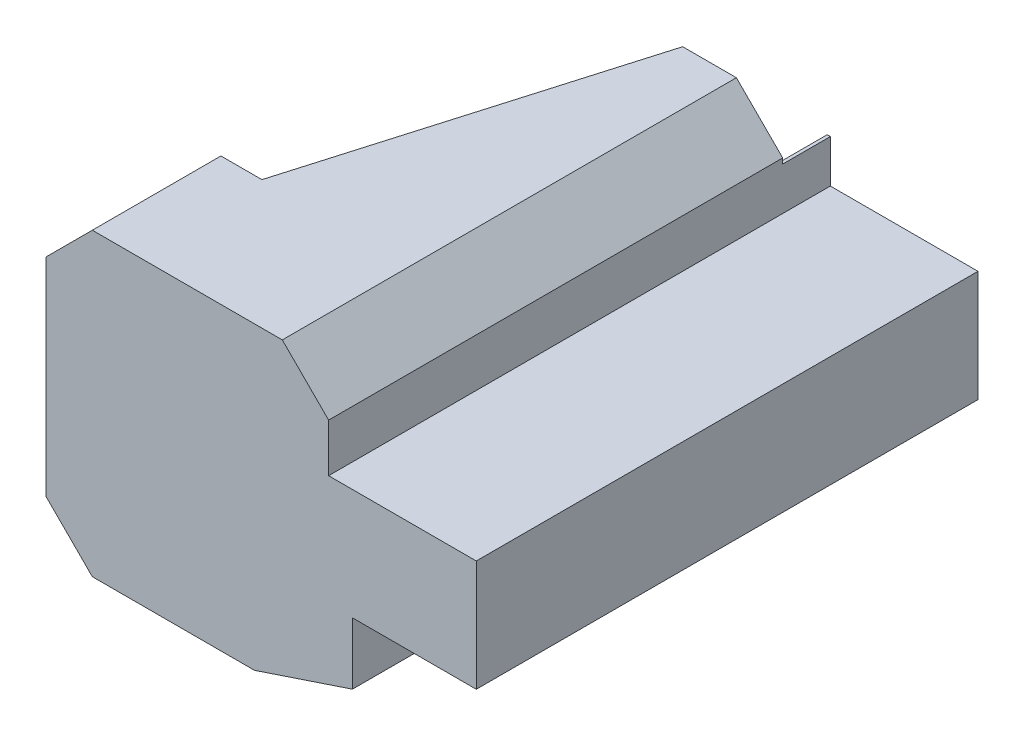
ISO-10303-21;
HEADER;
FILE_DESCRIPTION(('STEP AP214'),'2;1');
FILE_NAME('part.step','',(''),(''),'','','');
FILE_SCHEMA(('AUTOMOTIVE_DESIGN { 1 0 10303 214 1 1 1 1 }'));
ENDSEC;
DATA;
#1=APPLICATION_CONTEXT('core data for automotive mechanical design processes');
#2=APPLICATION_PROTOCOL_DEFINITION('international standard','automotive_design',2000,#1);
#3=PRODUCT_CONTEXT('',#1,'mechanical');
#4=PRODUCT('Part','Part','',(#3));
#5=PRODUCT_RELATED_PRODUCT_CATEGORY('part','',(#4));
#6=PRODUCT_DEFINITION_FORMATION('','',#4);
#7=PRODUCT_DEFINITION_CONTEXT('part definition',#1,'design');
#8=PRODUCT_DEFINITION('design','',#6,#7);
#9=PRODUCT_DEFINITION_SHAPE('','',#8);
#10=(LENGTH_UNIT() NAMED_UNIT(*) SI_UNIT(.MILLI.,.METRE.));
#11=(NAMED_UNIT(*) PLANE_ANGLE_UNIT() SI_UNIT($,.RADIAN.));
#12=(NAMED_UNIT(*) SI_UNIT($,.STERADIAN.) SOLID_ANGLE_UNIT());
#13=UNCERTAINTY_MEASURE_WITH_UNIT(LENGTH_MEASURE(1.E-05),#10,'distance_accuracy_value','');
#14=(GEOMETRIC_REPRESENTATION_CONTEXT(3) GLOBAL_UNCERTAINTY_ASSIGNED_CONTEXT((#13)) GLOBAL_UNIT_ASSIGNED_CONTEXT((#10,
#11,#12)) REPRESENTATION_CONTEXT('',''));
#15=CARTESIAN_POINT('',(0.,0.,0.));
#16=DIRECTION('',(0.,0.,1.));
#17=DIRECTION('',(1.,0.,0.));
#18=AXIS2_PLACEMENT_3D('',#15,#16,#17);
#19=CARTESIAN_POINT('',(0.,154.328427124746,-314.));
#20=DIRECTION('',(0.,0.,-1.));
#21=DIRECTION('',(-1.,0.,0.));
#22=AXIS2_PLACEMENT_3D('',#19,#20,#21);
#23=PLANE('',#22);
#24=DIRECTION('',(0.,1.,0.));
#25=VECTOR('',#24,1.);
#26=CARTESIAN_POINT('',(87.,33.,-314.));
#27=LINE('',#26,#25);
#28=CARTESIAN_POINT('',(87.,33.,-314.));
#29=VERTEX_POINT('',#28);
#30=CARTESIAN_POINT('',(87.,62.,-314.));
#31=VERTEX_POINT('',#30);
#32=EDGE_CURVE('E110',#29,#31,#27,.T.);
#33=ORIENTED_EDGE('',*,*,#32,.T.);
#34=DIRECTION('',(-1.,0.,0.));
#35=VECTOR('',#34,1.);
#36=CARTESIAN_POINT('',(-89.,62.,-314.));
#37=LINE('',#36,#35);
#38=CARTESIAN_POINT('',(89.,62.,-314.));
#39=VERTEX_POINT('',#38);
#40=EDGE_CURVE('E547',#39,#31,#37,.T.);
#41=ORIENTED_EDGE('',*,*,#40,.F.);
#42=DIRECTION('',(0.,-1.,0.));
#43=VECTOR('',#42,1.);
#44=CARTESIAN_POINT('',(89.,65.3284271247462,-314.));
#45=LINE('',#44,#43);
#46=CARTESIAN_POINT('',(89.,35.,-314.));
#47=VERTEX_POINT('',#46);
#48=EDGE_CURVE('E162',#39,#47,#45,.T.);
#49=ORIENTED_EDGE('',*,*,#48,.T.);
#50=DIRECTION('',(1.,0.,0.));
#51=VECTOR('',#50,1.);
#52=CARTESIAN_POINT('',(89.,35.,-314.));
#53=LINE('',#52,#51);
#54=CARTESIAN_POINT('',(182.,35.,-314.));
#55=VERTEX_POINT('',#54);
#56=EDGE_CURVE('E371',#47,#55,#53,.T.);
#57=ORIENTED_EDGE('',*,*,#56,.T.);
#58=DIRECTION('',(0.,-1.,0.));
#59=VECTOR('',#58,1.);
#60=CARTESIAN_POINT('',(182.,35.,-314.));
#61=LINE('',#60,#59);
#62=CARTESIAN_POINT('',(182.,-35.,-314.));
#63=VERTEX_POINT('',#62);
#64=EDGE_CURVE('E373',#55,#63,#61,.T.);
#65=ORIENTED_EDGE('',*,*,#64,.T.);
#66=DIRECTION('',(-1.,0.,0.));
#67=VECTOR('',#66,1.);
#68=CARTESIAN_POINT('',(182.,-35.,-314.));
#69=LINE('',#68,#67);
#70=CARTESIAN_POINT('',(104.,-35.,-314.));
#71=VERTEX_POINT('',#70);
#72=EDGE_CURVE('E375',#63,#71,#69,.T.);
#73=ORIENTED_EDGE('',*,*,#72,.T.);
#74=DIRECTION('',(0.,-1.,0.));
#75=VECTOR('',#74,1.);
#76=CARTESIAN_POINT('',(104.,-35.,-314.));
#77=LINE('',#76,#75);
#78=CARTESIAN_POINT('',(104.,-62.,-314.));
#79=VERTEX_POINT('',#78);
#80=EDGE_CURVE('E112',#71,#79,#77,.T.);
#81=ORIENTED_EDGE('',*,*,#80,.T.);
#82=DIRECTION('',(-1.,0.,0.));
#83=VECTOR('',#82,1.);
#84=CARTESIAN_POINT('',(0.,-62.,-314.));
#85=LINE('',#84,#83);
#86=CARTESIAN_POINT('',(102.,-62.,-314.));
#87=VERTEX_POINT('',#86);
#88=EDGE_CURVE('E25',#79,#87,#85,.T.);
#89=ORIENTED_EDGE('',*,*,#88,.T.);
#90=DIRECTION('',(0.,1.,0.));
#91=VECTOR('',#90,1.);
#92=CARTESIAN_POINT('',(102.,-33.,-314.));
#93=LINE('',#92,#91);
#94=CARTESIAN_POINT('',(102.,-33.,-314.));
#95=VERTEX_POINT('',#94);
#96=EDGE_CURVE('E40',#87,#95,#93,.T.);
#97=ORIENTED_EDGE('',*,*,#96,.T.);
#98=DIRECTION('',(1.,0.,0.));
#99=VECTOR('',#98,1.);
#100=CARTESIAN_POINT('',(180.,-33.,-314.));
#101=LINE('',#100,#99);
#102=CARTESIAN_POINT('',(180.,-33.,-314.));
#103=VERTEX_POINT('',#102);
#104=EDGE_CURVE('E90',#95,#103,#101,.T.);
#105=ORIENTED_EDGE('',*,*,#104,.T.);
#106=DIRECTION('',(0.,1.,0.));
#107=VECTOR('',#106,1.);
#108=CARTESIAN_POINT('',(180.,33.,-314.));
#109=LINE('',#108,#107);
#110=CARTESIAN_POINT('',(180.,33.,-314.));
#111=VERTEX_POINT('',#110);
#112=EDGE_CURVE('E83',#103,#111,#109,.T.);
#113=ORIENTED_EDGE('',*,*,#112,.T.);
#114=DIRECTION('',(-1.,0.,0.));
#115=VECTOR('',#114,1.);
#116=CARTESIAN_POINT('',(87.,33.,-314.));
#117=LINE('',#116,#115);
#118=EDGE_CURVE('E87',#111,#29,#117,.T.);
#119=ORIENTED_EDGE('',*,*,#118,.T.);
#120=EDGE_LOOP('',(#33,#41,#49,#57,#65,#73,#81,#89,#97,#105,#113,#119));
#121=FACE_BOUND('',#120,.T.);
#122=ADVANCED_FACE('F17',(#121),#23,.T.);
#123=CARTESIAN_POINT('',(-87.,64.5,-314.));
#124=DIRECTION('',(-1.,0.,0.));
#125=DIRECTION('',(0.,-1.,0.));
#126=AXIS2_PLACEMENT_3D('',#123,#124,#125);
#127=PLANE('',#126);
#128=DIRECTION('',(0.,-1.,0.));
#129=VECTOR('',#128,1.);
#130=CARTESIAN_POINT('',(-87.,64.5,-79.));
#131=LINE('',#130,#129);
#132=CARTESIAN_POINT('',(-87.,64.5,-79.));
#133=VERTEX_POINT('',#132);
#134=CARTESIAN_POINT('',(-87.,-64.5,-79.));
#135=VERTEX_POINT('',#134);
#136=EDGE_CURVE('E354',#133,#135,#131,.T.);
#137=ORIENTED_EDGE('',*,*,#136,.F.);
#138=DIRECTION('',(0.,0.,1.));
#139=VECTOR('',#138,1.);
#140=CARTESIAN_POINT('',(-87.,64.5,-314.));
#141=LINE('',#140,#139);
#142=CARTESIAN_POINT('',(-87.,64.5,0.));
#143=VERTEX_POINT('',#142);
#144=EDGE_CURVE('E187',#133,#143,#141,.T.);
#145=ORIENTED_EDGE('',*,*,#144,.T.);
#146=DIRECTION('',(0.,-1.,0.));
#147=VECTOR('',#146,1.);
#148=CARTESIAN_POINT('',(-87.,64.5,0.));
#149=LINE('',#148,#147);
#150=CARTESIAN_POINT('',(-87.,-64.5,0.));
#151=VERTEX_POINT('',#150);
#152=EDGE_CURVE('E53',#143,#151,#149,.T.);
#153=ORIENTED_EDGE('',*,*,#152,.T.);
#154=DIRECTION('',(0.,0.,1.));
#155=VECTOR('',#154,1.);
#156=CARTESIAN_POINT('',(-87.,-64.5,-314.));
#157=LINE('',#156,#155);
#158=EDGE_CURVE('E166',#135,#151,#157,.T.);
#159=ORIENTED_EDGE('',*,*,#158,.F.);
#160=EDGE_LOOP('',(#137,#145,#153,#159));
#161=FACE_BOUND('',#160,.T.);
#162=ADVANCED_FACE('F439',(#161),#127,.F.);
#163=CARTESIAN_POINT('',(-87.,-64.5,-314.));
#164=DIRECTION('',(-0.707106781186547,-0.707106781186548,0.));
#165=DIRECTION('',(0.707106781186548,-0.707106781186547,0.));
#166=AXIS2_PLACEMENT_3D('',#163,#164,#165);
#167=PLANE('',#166);
#168=DIRECTION('',(0.707106781186548,-0.707106781186547,0.));
#169=VECTOR('',#168,1.);
#170=CARTESIAN_POINT('',(-87.,-64.5,-79.));
#171=LINE('',#170,#169);
#172=CARTESIAN_POINT('',(-59.,-92.5,-79.));
#173=VERTEX_POINT('',#172);
#174=EDGE_CURVE('E419',#135,#173,#171,.T.);
#175=ORIENTED_EDGE('',*,*,#174,.F.);
#176=ORIENTED_EDGE('',*,*,#158,.T.);
#177=DIRECTION('',(0.707106781186548,-0.707106781186547,0.));
#178=VECTOR('',#177,1.);
#179=CARTESIAN_POINT('',(-87.,-64.5,0.));
#180=LINE('',#179,#178);
#181=CARTESIAN_POINT('',(-59.,-92.5,0.));
#182=VERTEX_POINT('',#181);
#183=EDGE_CURVE('E158',#151,#182,#180,.T.);
#184=ORIENTED_EDGE('',*,*,#183,.T.);
#185=DIRECTION('',(0.,0.,1.));
#186=VECTOR('',#185,1.);
#187=CARTESIAN_POINT('',(-59.,-92.5,-314.));
#188=LINE('',#187,#186);
#189=EDGE_CURVE('E163',#173,#182,#188,.T.);
#190=ORIENTED_EDGE('',*,*,#189,.F.);
#191=EDGE_LOOP('',(#175,#176,#184,#190));
#192=FACE_BOUND('',#191,.T.);
#193=ADVANCED_FACE('F444',(#192),#167,.F.);
#194=CARTESIAN_POINT('',(-59.,-92.5,-314.));
#195=DIRECTION('',(0.,-1.,0.));
#196=DIRECTION('',(0.,0.,-1.));
#197=AXIS2_PLACEMENT_3D('',#194,#195,#196);
#198=PLANE('',#197);
#199=DIRECTION('',(1.,0.,0.));
#200=VECTOR('',#199,1.);
#201=CARTESIAN_POINT('',(-59.,-92.5,-284.));
#202=LINE('',#201,#200);
#203=CARTESIAN_POINT('',(26.,-92.5,-284.));
#204=VERTEX_POINT('',#203);
#205=CARTESIAN_POINT('',(42.,-92.5,-284.));
#206=VERTEX_POINT('',#205);
#207=EDGE_CURVE('E65',#204,#206,#202,.T.);
#208=ORIENTED_EDGE('',*,*,#207,.F.);
#209=DIRECTION('',(0.280898753270714,0.,-0.959737407008271));
#210=VECTOR('',#209,1.);
#211=CARTESIAN_POINT('',(27.3808219178083,-92.5,-288.717808219178));
#212=LINE('',#211,#210);
#213=CARTESIAN_POINT('',(-34.,-92.5,-79.));
#214=VERTEX_POINT('',#213);
#215=EDGE_CURVE('E345',#214,#204,#212,.T.);
#216=ORIENTED_EDGE('',*,*,#215,.F.);
#217=DIRECTION('',(1.,0.,0.));
#218=VECTOR('',#217,1.);
#219=CARTESIAN_POINT('',(-59.,-92.5,-79.));
#220=LINE('',#219,#218);
#221=EDGE_CURVE('E417',#173,#214,#220,.T.);
#222=ORIENTED_EDGE('',*,*,#221,.F.);
#223=ORIENTED_EDGE('',*,*,#189,.T.);
#224=DIRECTION('',(1.,0.,0.));
#225=VECTOR('',#224,1.);
#226=CARTESIAN_POINT('',(-59.,-92.5,0.));
#227=LINE('',#226,#225);
#228=CARTESIAN_POINT('',(42.,-92.5,0.));
#229=VERTEX_POINT('',#228);
#230=EDGE_CURVE('E154',#182,#229,#227,.T.);
#231=ORIENTED_EDGE('',*,*,#230,.T.);
#232=DIRECTION('',(0.,0.,1.));
#233=VECTOR('',#232,1.);
#234=CARTESIAN_POINT('',(42.,-92.5,-314.));
#235=LINE('',#234,#233);
#236=EDGE_CURVE('E167',#206,#229,#235,.T.);
#237=ORIENTED_EDGE('',*,*,#236,.F.);
#238=EDGE_LOOP('',(#208,#216,#222,#223,#231,#237));
#239=FACE_BOUND('',#238,.T.);
#240=ADVANCED_FACE('F363',(#239),#198,.F.);
#241=CARTESIAN_POINT('',(42.,-92.5,-314.));
#242=DIRECTION('',(0.316175604762636,-0.94870068354196,0.));
#243=DIRECTION('',(0.94870068354196,0.316175604762636,0.));
#244=AXIS2_PLACEMENT_3D('',#241,#242,#243);
#245=PLANE('',#244);
#246=DIRECTION('',(0.94870068354196,0.316175604762636,0.));
#247=VECTOR('',#246,1.);
#248=CARTESIAN_POINT('',(42.,-92.5,-284.));
#249=LINE('',#248,#247);
#250=CARTESIAN_POINT('',(102.,-72.5036654185471,-284.));
#251=VERTEX_POINT('',#250);
#252=EDGE_CURVE('E364',#206,#251,#249,.T.);
#253=ORIENTED_EDGE('',*,*,#252,.F.);
#254=ORIENTED_EDGE('',*,*,#236,.T.);
#255=DIRECTION('',(0.94870068354196,0.316175604762636,0.));
#256=VECTOR('',#255,1.);
#257=CARTESIAN_POINT('',(42.,-92.5,0.));
#258=LINE('',#257,#256);
#259=CARTESIAN_POINT('',(102.,-72.5036654185471,0.));
#260=VERTEX_POINT('',#259);
#261=EDGE_CURVE('E150',#229,#260,#258,.T.);
#262=ORIENTED_EDGE('',*,*,#261,.T.);
#263=DIRECTION('',(0.,0.,1.));
#264=VECTOR('',#263,1.);
#265=CARTESIAN_POINT('',(102.,-72.5036654185471,-314.));
#266=LINE('',#265,#264);
#267=EDGE_CURVE('E170',#251,#260,#266,.T.);
#268=ORIENTED_EDGE('',*,*,#267,.F.);
#269=EDGE_LOOP('',(#253,#254,#262,#268));
#270=FACE_BOUND('',#269,.T.);
#271=ADVANCED_FACE('F454',(#270),#245,.F.);
#272=CARTESIAN_POINT('',(102.,-33.,-314.));
#273=DIRECTION('',(1.,0.,0.));
#274=DIRECTION('',(0.,0.,-1.));
#275=AXIS2_PLACEMENT_3D('',#272,#273,#274);
#276=PLANE('',#275);
#277=DIRECTION('',(0.,1.,0.));
#278=VECTOR('',#277,1.);
#279=CARTESIAN_POINT('',(102.,-33.,-284.));
#280=LINE('',#279,#278);
#281=CARTESIAN_POINT('',(102.,-62.,-284.));
#282=VERTEX_POINT('',#281);
#283=EDGE_CURVE('E366',#251,#282,#280,.T.);
#284=ORIENTED_EDGE('',*,*,#283,.F.);
#285=ORIENTED_EDGE('',*,*,#267,.T.);
#286=DIRECTION('',(0.,1.,0.));
#287=VECTOR('',#286,1.);
#288=CARTESIAN_POINT('',(102.,-33.,0.));
#289=LINE('',#288,#287);
#290=CARTESIAN_POINT('',(102.,-33.,0.));
#291=VERTEX_POINT('',#290);
#292=EDGE_CURVE('E146',#260,#291,#289,.T.);
#293=ORIENTED_EDGE('',*,*,#292,.T.);
#294=DIRECTION('',(0.,0.,1.));
#295=VECTOR('',#294,1.);
#296=CARTESIAN_POINT('',(102.,-33.,-314.));
#297=LINE('',#296,#295);
#298=EDGE_CURVE('E173',#95,#291,#297,.T.);
#299=ORIENTED_EDGE('',*,*,#298,.F.);
#300=ORIENTED_EDGE('',*,*,#96,.F.);
#301=DIRECTION('',(0.,0.,-1.));
#302=VECTOR('',#301,1.);
#303=CARTESIAN_POINT('',(102.,-62.,-314.));
#304=LINE('',#303,#302);
#305=EDGE_CURVE('E241',#282,#87,#304,.T.);
#306=ORIENTED_EDGE('',*,*,#305,.F.);
#307=EDGE_LOOP('',(#284,#285,#293,#299,#300,#306));
#308=FACE_BOUND('',#307,.T.);
#309=ADVANCED_FACE('F240',(#308),#276,.F.);
#310=CARTESIAN_POINT('',(104.,-35.,-314.));
#311=DIRECTION('',(-1.,0.,0.));
#312=DIRECTION('',(0.,0.,1.));
#313=AXIS2_PLACEMENT_3D('',#310,#311,#312);
#314=PLANE('',#313);
#315=DIRECTION('',(0.,-1.,0.));
#316=VECTOR('',#315,1.);
#317=CARTESIAN_POINT('',(104.,-62.,-284.));
#318=LINE('',#317,#316);
#319=CARTESIAN_POINT('',(104.,-62.,-284.));
#320=VERTEX_POINT('',#319);
#321=CARTESIAN_POINT('',(104.,-73.9452674055602,-284.));
#322=VERTEX_POINT('',#321);
#323=EDGE_CURVE('E360',#320,#322,#318,.T.);
#324=ORIENTED_EDGE('',*,*,#323,.F.);
#325=DIRECTION('',(0.,0.,-1.));
#326=VECTOR('',#325,1.);
#327=CARTESIAN_POINT('',(104.,-62.,-284.));
#328=LINE('',#327,#326);
#329=EDGE_CURVE('E391',#320,#79,#328,.T.);
#330=ORIENTED_EDGE('',*,*,#329,.T.);
#331=ORIENTED_EDGE('',*,*,#80,.F.);
#332=DIRECTION('',(0.,0.,1.));
#333=VECTOR('',#332,1.);
#334=CARTESIAN_POINT('',(104.,-35.,-314.));
#335=LINE('',#334,#333);
#336=CARTESIAN_POINT('',(104.,-35.,2.00000000000008));
#337=VERTEX_POINT('',#336);
#338=EDGE_CURVE('E206',#71,#337,#335,.T.);
#339=ORIENTED_EDGE('',*,*,#338,.T.);
#340=DIRECTION('',(0.,-1.,0.));
#341=VECTOR('',#340,1.);
#342=CARTESIAN_POINT('',(104.,-35.,2.00000000000008));
#343=LINE('',#342,#341);
#344=CARTESIAN_POINT('',(104.,-73.9452674055601,2.00000000000008));
#345=VERTEX_POINT('',#344);
#346=EDGE_CURVE('E1277',#337,#345,#343,.T.);
#347=ORIENTED_EDGE('',*,*,#346,.T.);
#348=DIRECTION('',(0.,0.,1.));
#349=VECTOR('',#348,1.);
#350=CARTESIAN_POINT('',(104.,-73.9452674055602,-314.));
#351=LINE('',#350,#349);
#352=EDGE_CURVE('E203',#322,#345,#351,.T.);
#353=ORIENTED_EDGE('',*,*,#352,.F.);
#354=EDGE_LOOP('',(#324,#330,#331,#339,#347,#353));
#355=FACE_BOUND('',#354,.T.);
#356=ADVANCED_FACE('F390',(#355),#314,.F.);
#357=CARTESIAN_POINT('',(42.3244988903971,-94.5,-314.));
#358=DIRECTION('',(-0.316175604762635,0.94870068354196,0.));
#359=DIRECTION('',(-0.94870068354196,-0.316175604762635,0.));
#360=AXIS2_PLACEMENT_3D('',#357,#358,#359);
#361=PLANE('',#360);
#362=DIRECTION('',(-0.94870068354196,-0.316175604762635,0.));
#363=VECTOR('',#362,1.);
#364=CARTESIAN_POINT('',(42.3244988903971,-94.5,-284.));
#365=LINE('',#364,#363);
#366=CARTESIAN_POINT('',(42.3244988903971,-94.5,-284.));
#367=VERTEX_POINT('',#366);
#368=EDGE_CURVE('E353',#322,#367,#365,.T.);
#369=ORIENTED_EDGE('',*,*,#368,.F.);
#370=ORIENTED_EDGE('',*,*,#352,.T.);
#371=DIRECTION('',(-0.94870068354196,-0.316175604762635,0.));
#372=VECTOR('',#371,1.);
#373=CARTESIAN_POINT('',(104.,-73.9452674055601,2.00000000000008));
#374=LINE('',#373,#372);
#375=CARTESIAN_POINT('',(42.3244988903971,-94.5,2.00000000000008));
#376=VERTEX_POINT('',#375);
#377=EDGE_CURVE('E1280',#345,#376,#374,.T.);
#378=ORIENTED_EDGE('',*,*,#377,.T.);
#379=DIRECTION('',(0.,0.,1.));
#380=VECTOR('',#379,1.);
#381=CARTESIAN_POINT('',(42.3244988903971,-94.5,-314.));
#382=LINE('',#381,#380);
#383=EDGE_CURVE('E200',#367,#376,#382,.T.);
#384=ORIENTED_EDGE('',*,*,#383,.F.);
#385=EDGE_LOOP('',(#369,#370,#378,#384));
#386=FACE_BOUND('',#385,.T.);
#387=ADVANCED_FACE('F488',(#386),#361,.F.);
#388=CARTESIAN_POINT('',(42.3244988903971,-94.5,-314.));
#389=DIRECTION('',(0.,1.,0.));
#390=DIRECTION('',(0.,0.,1.));
#391=AXIS2_PLACEMENT_3D('',#388,#389,#390);
#392=PLANE('',#391);
#393=DIRECTION('',(1.,0.,0.));
#394=VECTOR('',#393,1.);
#395=CARTESIAN_POINT('',(26.,-94.5,-284.));
#396=LINE('',#395,#394);
#397=CARTESIAN_POINT('',(26.,-94.5,-284.));
#398=VERTEX_POINT('',#397);
#399=EDGE_CURVE('E358',#398,#367,#396,.T.);
#400=ORIENTED_EDGE('',*,*,#399,.T.);
#401=ORIENTED_EDGE('',*,*,#383,.T.);
#402=DIRECTION('',(-1.,0.,0.));
#403=VECTOR('',#402,1.);
#404=CARTESIAN_POINT('',(42.3244988903971,-94.5,2.00000000000008));
#405=LINE('',#404,#403);
#406=CARTESIAN_POINT('',(-59.8284271247461,-94.5,2.00000000000008));
#407=VERTEX_POINT('',#406);
#408=EDGE_CURVE('E1284',#376,#407,#405,.T.);
#409=ORIENTED_EDGE('',*,*,#408,.T.);
#410=DIRECTION('',(0.,0.,1.));
#411=VECTOR('',#410,1.);
#412=CARTESIAN_POINT('',(-59.8284271247462,-94.5,-314.));
#413=LINE('',#412,#411);
#414=CARTESIAN_POINT('',(-59.8284271247462,-94.5,-79.));
#415=VERTEX_POINT('',#414);
#416=EDGE_CURVE('E197',#415,#407,#413,.T.);
#417=ORIENTED_EDGE('',*,*,#416,.F.);
#418=DIRECTION('',(1.,0.,0.));
#419=VECTOR('',#418,1.);
#420=CARTESIAN_POINT('',(-89.,-94.5,-79.));
#421=LINE('',#420,#419);
#422=CARTESIAN_POINT('',(-34.,-94.5,-79.));
#423=VERTEX_POINT('',#422);
#424=EDGE_CURVE('E395',#415,#423,#421,.T.);
#425=ORIENTED_EDGE('',*,*,#424,.T.);
#426=DIRECTION('',(0.280898753270714,0.,-0.959737407008271));
#427=VECTOR('',#426,1.);
#428=CARTESIAN_POINT('',(26.,-94.5,-284.));
#429=LINE('',#428,#427);
#430=EDGE_CURVE('E401',#423,#398,#429,.T.);
#431=ORIENTED_EDGE('',*,*,#430,.T.);
#432=EDGE_LOOP('',(#400,#401,#409,#417,#425,#431));
#433=FACE_BOUND('',#432,.T.);
#434=ADVANCED_FACE('F484',(#433),#392,.F.);
#435=CARTESIAN_POINT('',(-59.8284271247462,-94.5,-314.));
#436=DIRECTION('',(0.707106781186547,0.707106781186548,0.));
#437=DIRECTION('',(-0.707106781186548,0.707106781186548,0.));
#438=AXIS2_PLACEMENT_3D('',#435,#436,#437);
#439=PLANE('',#438);
#440=DIRECTION('',(-0.707106781186548,0.707106781186548,0.));
#441=VECTOR('',#440,1.);
#442=CARTESIAN_POINT('',(-59.8284271247462,-94.5,-79.));
#443=LINE('',#442,#441);
#444=CARTESIAN_POINT('',(-89.,-65.3284271247462,-79.));
#445=VERTEX_POINT('',#444);
#446=EDGE_CURVE('E415',#415,#445,#443,.T.);
#447=ORIENTED_EDGE('',*,*,#446,.F.);
#448=ORIENTED_EDGE('',*,*,#416,.T.);
#449=DIRECTION('',(-0.707106781186548,0.707106781186548,0.));
#450=VECTOR('',#449,1.);
#451=CARTESIAN_POINT('',(-59.8284271247461,-94.5,2.00000000000008));
#452=LINE('',#451,#450);
#453=CARTESIAN_POINT('',(-89.,-65.3284271247462,2.00000000000008));
#454=VERTEX_POINT('',#453);
#455=EDGE_CURVE('E587',#407,#454,#452,.T.);
#456=ORIENTED_EDGE('',*,*,#455,.T.);
#457=DIRECTION('',(0.,0.,1.));
#458=VECTOR('',#457,1.);
#459=CARTESIAN_POINT('',(-89.,-65.3284271247462,-314.));
#460=LINE('',#459,#458);
#461=EDGE_CURVE('E194',#445,#454,#460,.T.);
#462=ORIENTED_EDGE('',*,*,#461,.F.);
#463=EDGE_LOOP('',(#447,#448,#456,#462));
#464=FACE_BOUND('',#463,.T.);
#465=ADVANCED_FACE('F462',(#464),#439,.F.);
#466=CARTESIAN_POINT('',(180.,-33.,-314.));
#467=DIRECTION('',(0.,-1.,0.));
#468=DIRECTION('',(0.,0.,-1.));
#469=AXIS2_PLACEMENT_3D('',#466,#467,#468);
#470=PLANE('',#469);
#471=DIRECTION('',(1.,0.,0.));
#472=VECTOR('',#471,1.);
#473=CARTESIAN_POINT('',(180.,-33.,0.));
#474=LINE('',#473,#472);
#475=CARTESIAN_POINT('',(180.,-33.,0.));
#476=VERTEX_POINT('',#475);
#477=EDGE_CURVE('E142',#291,#476,#474,.T.);
#478=ORIENTED_EDGE('',*,*,#477,.T.);
#479=DIRECTION('',(0.,0.,1.));
#480=VECTOR('',#479,1.);
#481=CARTESIAN_POINT('',(180.,-33.,-314.));
#482=LINE('',#481,#480);
#483=EDGE_CURVE('E104',#103,#476,#482,.T.);
#484=ORIENTED_EDGE('',*,*,#483,.F.);
#485=ORIENTED_EDGE('',*,*,#104,.F.);
#486=ORIENTED_EDGE('',*,*,#298,.T.);
#487=EDGE_LOOP('',(#478,#484,#485,#486));
#488=FACE_BOUND('',#487,.T.);
#489=ADVANCED_FACE('F245',(#488),#470,.F.);
#490=CARTESIAN_POINT('',(180.,33.,-314.));
#491=DIRECTION('',(1.,0.,0.));
#492=DIRECTION('',(0.,0.,-1.));
#493=AXIS2_PLACEMENT_3D('',#490,#491,#492);
#494=PLANE('',#493);
#495=DIRECTION('',(0.,1.,0.));
#496=VECTOR('',#495,1.);
#497=CARTESIAN_POINT('',(180.,33.,0.));
#498=LINE('',#497,#496);
#499=CARTESIAN_POINT('',(180.,33.,0.));
#500=VERTEX_POINT('',#499);
#501=EDGE_CURVE('E101',#476,#500,#498,.T.);
#502=ORIENTED_EDGE('',*,*,#501,.T.);
#503=DIRECTION('',(0.,0.,1.));
#504=VECTOR('',#503,1.);
#505=CARTESIAN_POINT('',(180.,33.,-314.));
#506=LINE('',#505,#504);
#507=EDGE_CURVE('E97',#111,#500,#506,.T.);
#508=ORIENTED_EDGE('',*,*,#507,.F.);
#509=ORIENTED_EDGE('',*,*,#112,.F.);
#510=ORIENTED_EDGE('',*,*,#483,.T.);
#511=EDGE_LOOP('',(#502,#508,#509,#510));
#512=FACE_BOUND('',#511,.T.);
#513=ADVANCED_FACE('F98',(#512),#494,.F.);
#514=CARTESIAN_POINT('',(87.,33.,-314.));
#515=DIRECTION('',(0.,1.,0.));
#516=DIRECTION('',(-1.,0.,0.));
#517=AXIS2_PLACEMENT_3D('',#514,#515,#516);
#518=PLANE('',#517);
#519=DIRECTION('',(-1.,0.,0.));
#520=VECTOR('',#519,1.);
#521=CARTESIAN_POINT('',(87.,33.,0.));
#522=LINE('',#521,#520);
#523=CARTESIAN_POINT('',(87.,33.,0.));
#524=VERTEX_POINT('',#523);
#525=EDGE_CURVE('E137',#500,#524,#522,.T.);
#526=ORIENTED_EDGE('',*,*,#525,.T.);
#527=DIRECTION('',(0.,0.,1.));
#528=VECTOR('',#527,1.);
#529=CARTESIAN_POINT('',(87.,33.,-314.));
#530=LINE('',#529,#528);
#531=EDGE_CURVE('E105',#29,#524,#530,.T.);
#532=ORIENTED_EDGE('',*,*,#531,.F.);
#533=ORIENTED_EDGE('',*,*,#118,.F.);
#534=ORIENTED_EDGE('',*,*,#507,.T.);
#535=EDGE_LOOP('',(#526,#532,#533,#534));
#536=FACE_BOUND('',#535,.T.);
#537=ADVANCED_FACE('F107',(#536),#518,.F.);
#538=CARTESIAN_POINT('',(87.,33.,-314.));
#539=DIRECTION('',(1.,0.,0.));
#540=DIRECTION('',(0.,1.,0.));
#541=AXIS2_PLACEMENT_3D('',#538,#539,#540);
#542=PLANE('',#541);
#543=DIRECTION('',(0.,0.,1.));
#544=VECTOR('',#543,1.);
#545=CARTESIAN_POINT('',(87.,64.5,-314.));
#546=LINE('',#545,#544);
#547=CARTESIAN_POINT('',(87.,64.5,-284.));
#548=VERTEX_POINT('',#547);
#549=CARTESIAN_POINT('',(87.,64.5,0.));
#550=VERTEX_POINT('',#549);
#551=EDGE_CURVE('E178',#548,#550,#546,.T.);
#552=ORIENTED_EDGE('',*,*,#551,.F.);
#553=DIRECTION('',(0.,-1.,0.));
#554=VECTOR('',#553,1.);
#555=CARTESIAN_POINT('',(87.,33.,-284.));
#556=LINE('',#555,#554);
#557=CARTESIAN_POINT('',(87.,62.,-284.));
#558=VERTEX_POINT('',#557);
#559=EDGE_CURVE('E566',#548,#558,#556,.T.);
#560=ORIENTED_EDGE('',*,*,#559,.T.);
#561=DIRECTION('',(0.,0.,1.));
#562=VECTOR('',#561,1.);
#563=CARTESIAN_POINT('',(87.,62.,-314.));
#564=LINE('',#563,#562);
#565=EDGE_CURVE('E555',#31,#558,#564,.T.);
#566=ORIENTED_EDGE('',*,*,#565,.F.);
#567=ORIENTED_EDGE('',*,*,#32,.F.);
#568=ORIENTED_EDGE('',*,*,#531,.T.);
#569=DIRECTION('',(0.,1.,0.));
#570=VECTOR('',#569,1.);
#571=CARTESIAN_POINT('',(87.,33.,0.));
#572=LINE('',#571,#570);
#573=EDGE_CURVE('E133',#524,#550,#572,.T.);
#574=ORIENTED_EDGE('',*,*,#573,.T.);
#575=EDGE_LOOP('',(#552,#560,#566,#567,#568,#574));
#576=FACE_BOUND('',#575,.T.);
#577=ADVANCED_FACE('F467',(#576),#542,.F.);
#578=CARTESIAN_POINT('',(59.,92.5,-314.));
#579=DIRECTION('',(0.707106781186548,0.707106781186548,0.));
#580=DIRECTION('',(-0.707106781186548,0.707106781186548,0.));
#581=AXIS2_PLACEMENT_3D('',#578,#579,#580);
#582=PLANE('',#581);
#583=DIRECTION('',(0.,0.,1.));
#584=VECTOR('',#583,1.);
#585=CARTESIAN_POINT('',(59.,92.5,-314.));
#586=LINE('',#585,#584);
#587=CARTESIAN_POINT('',(59.,92.5,-284.));
#588=VERTEX_POINT('',#587);
#589=CARTESIAN_POINT('',(59.,92.5,0.));
#590=VERTEX_POINT('',#589);
#591=EDGE_CURVE('E181',#588,#590,#586,.T.);
#592=ORIENTED_EDGE('',*,*,#591,.F.);
#593=DIRECTION('',(0.707106781186548,-0.707106781186548,0.));
#594=VECTOR('',#593,1.);
#595=CARTESIAN_POINT('',(59.,92.5,-284.));
#596=LINE('',#595,#594);
#597=EDGE_CURVE('E563',#588,#548,#596,.T.);
#598=ORIENTED_EDGE('',*,*,#597,.T.);
#599=ORIENTED_EDGE('',*,*,#551,.T.);
#600=DIRECTION('',(-0.707106781186548,0.707106781186548,0.));
#601=VECTOR('',#600,1.);
#602=CARTESIAN_POINT('',(59.,92.5,0.));
#603=LINE('',#602,#601);
#604=EDGE_CURVE('E129',#550,#590,#603,.T.);
#605=ORIENTED_EDGE('',*,*,#604,.T.);
#606=EDGE_LOOP('',(#592,#598,#599,#605));
#607=FACE_BOUND('',#606,.T.);
#608=ADVANCED_FACE('F470',(#607),#582,.F.);
#609=CARTESIAN_POINT('',(59.,92.5,-314.));
#610=DIRECTION('',(0.,1.,0.));
#611=DIRECTION('',(-1.,0.,0.));
#612=AXIS2_PLACEMENT_3D('',#609,#610,#611);
#613=PLANE('',#612);
#614=DIRECTION('',(0.,0.,1.));
#615=VECTOR('',#614,1.);
#616=CARTESIAN_POINT('',(-59.,92.5,-314.));
#617=LINE('',#616,#615);
#618=CARTESIAN_POINT('',(-59.,92.5,-79.));
#619=VERTEX_POINT('',#618);
#620=CARTESIAN_POINT('',(-59.,92.5,0.));
#621=VERTEX_POINT('',#620);
#622=EDGE_CURVE('E184',#619,#621,#617,.T.);
#623=ORIENTED_EDGE('',*,*,#622,.F.);
#624=DIRECTION('',(1.,0.,0.));
#625=VECTOR('',#624,1.);
#626=CARTESIAN_POINT('',(59.,92.5,-79.));
#627=LINE('',#626,#625);
#628=CARTESIAN_POINT('',(-34.,92.5,-79.));
#629=VERTEX_POINT('',#628);
#630=EDGE_CURVE('E32',#619,#629,#627,.T.);
#631=ORIENTED_EDGE('',*,*,#630,.T.);
#632=DIRECTION('',(0.280898753270714,0.,-0.959737407008271));
#633=VECTOR('',#632,1.);
#634=CARTESIAN_POINT('',(36.6915068493151,92.5,-320.529315068493));
#635=LINE('',#634,#633);
#636=CARTESIAN_POINT('',(26.,92.5,-284.));
#637=VERTEX_POINT('',#636);
#638=EDGE_CURVE('E409',#629,#637,#635,.T.);
#639=ORIENTED_EDGE('',*,*,#638,.T.);
#640=DIRECTION('',(1.,0.,0.));
#641=VECTOR('',#640,1.);
#642=CARTESIAN_POINT('',(59.,92.5,-284.));
#643=LINE('',#642,#641);
#644=EDGE_CURVE('E560',#637,#588,#643,.T.);
#645=ORIENTED_EDGE('',*,*,#644,.T.);
#646=ORIENTED_EDGE('',*,*,#591,.T.);
#647=DIRECTION('',(-1.,0.,0.));
#648=VECTOR('',#647,1.);
#649=CARTESIAN_POINT('',(59.,92.5,0.));
#650=LINE('',#649,#648);
#651=EDGE_CURVE('E125',#590,#621,#650,.T.);
#652=ORIENTED_EDGE('',*,*,#651,.T.);
#653=EDGE_LOOP('',(#623,#631,#639,#645,#646,#652));
#654=FACE_BOUND('',#653,.T.);
#655=ADVANCED_FACE('F474',(#654),#613,.F.);
#656=CARTESIAN_POINT('',(-89.,65.3284271247462,-314.));
#657=DIRECTION('',(0.707106781186548,-0.707106781186548,0.));
#658=DIRECTION('',(0.707106781186548,0.707106781186548,0.));
#659=AXIS2_PLACEMENT_3D('',#656,#657,#658);
#660=PLANE('',#659);
#661=DIRECTION('',(0.,0.,1.));
#662=VECTOR('',#661,1.);
#663=CARTESIAN_POINT('',(-59.8284271247462,94.5,-314.));
#664=LINE('',#663,#662);
#665=CARTESIAN_POINT('',(-59.8284271247462,94.5,-79.));
#666=VERTEX_POINT('',#665);
#667=CARTESIAN_POINT('',(-59.8284271247461,94.5,2.00000000000008));
#668=VERTEX_POINT('',#667);
#669=EDGE_CURVE('E191',#666,#668,#664,.T.);
#670=ORIENTED_EDGE('',*,*,#669,.F.);
#671=DIRECTION('',(-0.707106781186548,-0.707106781186548,0.));
#672=VECTOR('',#671,1.);
#673=CARTESIAN_POINT('',(-89.,65.3284271247462,-79.));
#674=LINE('',#673,#672);
#675=CARTESIAN_POINT('',(-89.,65.3284271247462,-79.));
#676=VERTEX_POINT('',#675);
#677=EDGE_CURVE('E552',#666,#676,#674,.T.);
#678=ORIENTED_EDGE('',*,*,#677,.T.);
#679=DIRECTION('',(0.,0.,1.));
#680=VECTOR('',#679,1.);
#681=CARTESIAN_POINT('',(-89.,65.3284271247462,-314.));
#682=LINE('',#681,#680);
#683=CARTESIAN_POINT('',(-89.,65.3284271247462,2.00000000000008));
#684=VERTEX_POINT('',#683);
#685=EDGE_CURVE('E118',#676,#684,#682,.T.);
#686=ORIENTED_EDGE('',*,*,#685,.T.);
#687=DIRECTION('',(0.707106781186548,0.707106781186548,0.));
#688=VECTOR('',#687,1.);
#689=CARTESIAN_POINT('',(-89.,65.3284271247462,2.00000000000008));
#690=LINE('',#689,#688);
#691=EDGE_CURVE('E590',#684,#668,#690,.T.);
#692=ORIENTED_EDGE('',*,*,#691,.T.);
#693=EDGE_LOOP('',(#670,#678,#686,#692));
#694=FACE_BOUND('',#693,.T.);
#695=ADVANCED_FACE('F19',(#694),#660,.F.);
#696=CARTESIAN_POINT('',(-59.8284271247462,94.5,-314.));
#697=DIRECTION('',(0.,-1.,0.));
#698=DIRECTION('',(0.,0.,-1.));
#699=AXIS2_PLACEMENT_3D('',#696,#697,#698);
#700=PLANE('',#699);
#701=DIRECTION('',(0.280898753270714,0.,-0.959737407008271));
#702=VECTOR('',#701,1.);
#703=CARTESIAN_POINT('',(26.,94.5,-284.));
#704=LINE('',#703,#702);
#705=CARTESIAN_POINT('',(-34.,94.5,-79.));
#706=VERTEX_POINT('',#705);
#707=CARTESIAN_POINT('',(26.,94.5,-284.));
#708=VERTEX_POINT('',#707);
#709=EDGE_CURVE('E523',#706,#708,#704,.T.);
#710=ORIENTED_EDGE('',*,*,#709,.F.);
#711=DIRECTION('',(1.,0.,0.));
#712=VECTOR('',#711,1.);
#713=CARTESIAN_POINT('',(-89.,94.5,-79.));
#714=LINE('',#713,#712);
#715=EDGE_CURVE('E525',#666,#706,#714,.T.);
#716=ORIENTED_EDGE('',*,*,#715,.F.);
#717=ORIENTED_EDGE('',*,*,#669,.T.);
#718=DIRECTION('',(1.,0.,0.));
#719=VECTOR('',#718,1.);
#720=CARTESIAN_POINT('',(-59.8284271247461,94.5,2.00000000000008));
#721=LINE('',#720,#719);
#722=CARTESIAN_POINT('',(59.8284271247462,94.5,2.00000000000008));
#723=VERTEX_POINT('',#722);
#724=EDGE_CURVE('E595',#668,#723,#721,.T.);
#725=ORIENTED_EDGE('',*,*,#724,.T.);
#726=DIRECTION('',(0.,0.,1.));
#727=VECTOR('',#726,1.);
#728=CARTESIAN_POINT('',(59.8284271247462,94.5,-314.));
#729=LINE('',#728,#727);
#730=CARTESIAN_POINT('',(59.8284271247462,94.5,-284.));
#731=VERTEX_POINT('',#730);
#732=EDGE_CURVE('E221',#731,#723,#729,.T.);
#733=ORIENTED_EDGE('',*,*,#732,.F.);
#734=DIRECTION('',(1.,0.,0.));
#735=VECTOR('',#734,1.);
#736=CARTESIAN_POINT('',(26.,94.5,-284.));
#737=LINE('',#736,#735);
#738=EDGE_CURVE('E528',#708,#731,#737,.T.);
#739=ORIENTED_EDGE('',*,*,#738,.F.);
#740=EDGE_LOOP('',(#710,#716,#717,#725,#733,#739));
#741=FACE_BOUND('',#740,.T.);
#742=ADVANCED_FACE('F511',(#741),#700,.F.);
#743=CARTESIAN_POINT('',(59.8284271247462,94.5,-314.));
#744=DIRECTION('',(-0.707106781186548,-0.707106781186548,0.));
#745=DIRECTION('',(0.707106781186548,-0.707106781186548,0.));
#746=AXIS2_PLACEMENT_3D('',#743,#744,#745);
#747=PLANE('',#746);
#748=DIRECTION('',(0.,0.,1.));
#749=VECTOR('',#748,1.);
#750=CARTESIAN_POINT('',(89.,65.3284271247462,-314.));
#751=LINE('',#750,#749);
#752=CARTESIAN_POINT('',(89.,65.3284271247462,-284.));
#753=VERTEX_POINT('',#752);
#754=CARTESIAN_POINT('',(89.,65.3284271247462,2.00000000000008));
#755=VERTEX_POINT('',#754);
#756=EDGE_CURVE('E218',#753,#755,#751,.T.);
#757=ORIENTED_EDGE('',*,*,#756,.F.);
#758=DIRECTION('',(-0.707106781186548,0.707106781186548,0.));
#759=VECTOR('',#758,1.);
#760=CARTESIAN_POINT('',(59.8284271247462,94.5,-284.));
#761=LINE('',#760,#759);
#762=EDGE_CURVE('E557',#753,#731,#761,.T.);
#763=ORIENTED_EDGE('',*,*,#762,.T.);
#764=ORIENTED_EDGE('',*,*,#732,.T.);
#765=DIRECTION('',(0.707106781186548,-0.707106781186548,0.));
#766=VECTOR('',#765,1.);
#767=CARTESIAN_POINT('',(59.8284271247462,94.5,2.00000000000008));
#768=LINE('',#767,#766);
#769=EDGE_CURVE('E600',#723,#755,#768,.T.);
#770=ORIENTED_EDGE('',*,*,#769,.T.);
#771=EDGE_LOOP('',(#757,#763,#764,#770));
#772=FACE_BOUND('',#771,.T.);
#773=ADVANCED_FACE('F508',(#772),#747,.F.);
#774=CARTESIAN_POINT('',(89.,65.3284271247462,-314.));
#775=DIRECTION('',(-1.,0.,0.));
#776=DIRECTION('',(0.,0.,1.));
#777=AXIS2_PLACEMENT_3D('',#774,#775,#776);
#778=PLANE('',#777);
#779=DIRECTION('',(0.,0.,-1.));
#780=VECTOR('',#779,1.);
#781=CARTESIAN_POINT('',(89.,62.,-314.));
#782=LINE('',#781,#780);
#783=CARTESIAN_POINT('',(89.,62.,-284.));
#784=VERTEX_POINT('',#783);
#785=EDGE_CURVE('E605',#784,#39,#782,.T.);
#786=ORIENTED_EDGE('',*,*,#785,.F.);
#787=DIRECTION('',(0.,1.,0.));
#788=VECTOR('',#787,1.);
#789=CARTESIAN_POINT('',(89.,62.,-284.));
#790=LINE('',#789,#788);
#791=EDGE_CURVE('E543',#784,#753,#790,.T.);
#792=ORIENTED_EDGE('',*,*,#791,.T.);
#793=ORIENTED_EDGE('',*,*,#756,.T.);
#794=DIRECTION('',(0.,-1.,0.));
#795=VECTOR('',#794,1.);
#796=CARTESIAN_POINT('',(89.,65.3284271247462,2.00000000000008));
#797=LINE('',#796,#795);
#798=CARTESIAN_POINT('',(89.,35.,2.00000000000008));
#799=VERTEX_POINT('',#798);
#800=EDGE_CURVE('E1259',#755,#799,#797,.T.);
#801=ORIENTED_EDGE('',*,*,#800,.T.);
#802=DIRECTION('',(0.,0.,1.));
#803=VECTOR('',#802,1.);
#804=CARTESIAN_POINT('',(89.,35.,-314.));
#805=LINE('',#804,#803);
#806=EDGE_CURVE('E215',#47,#799,#805,.T.);
#807=ORIENTED_EDGE('',*,*,#806,.F.);
#808=ORIENTED_EDGE('',*,*,#48,.F.);
#809=EDGE_LOOP('',(#786,#792,#793,#801,#807,#808));
#810=FACE_BOUND('',#809,.T.);
#811=ADVANCED_FACE('F504',(#810),#778,.F.);
#812=CARTESIAN_POINT('',(89.,35.,-314.));
#813=DIRECTION('',(0.,-1.,0.));
#814=DIRECTION('',(0.,0.,-1.));
#815=AXIS2_PLACEMENT_3D('',#812,#813,#814);
#816=PLANE('',#815);
#817=ORIENTED_EDGE('',*,*,#806,.T.);
#818=DIRECTION('',(1.,0.,0.));
#819=VECTOR('',#818,1.);
#820=CARTESIAN_POINT('',(89.,35.,2.00000000000008));
#821=LINE('',#820,#819);
#822=CARTESIAN_POINT('',(182.,35.,2.00000000000008));
#823=VERTEX_POINT('',#822);
#824=EDGE_CURVE('E1265',#799,#823,#821,.T.);
#825=ORIENTED_EDGE('',*,*,#824,.T.);
#826=DIRECTION('',(0.,0.,1.));
#827=VECTOR('',#826,1.);
#828=CARTESIAN_POINT('',(182.,35.,-314.));
#829=LINE('',#828,#827);
#830=EDGE_CURVE('E212',#55,#823,#829,.T.);
#831=ORIENTED_EDGE('',*,*,#830,.F.);
#832=ORIENTED_EDGE('',*,*,#56,.F.);
#833=EDGE_LOOP('',(#817,#825,#831,#832));
#834=FACE_BOUND('',#833,.T.);
#835=ADVANCED_FACE('F500',(#834),#816,.F.);
#836=CARTESIAN_POINT('',(182.,35.,-314.));
#837=DIRECTION('',(-1.,0.,0.));
#838=DIRECTION('',(0.,0.,1.));
#839=AXIS2_PLACEMENT_3D('',#836,#837,#838);
#840=PLANE('',#839);
#841=ORIENTED_EDGE('',*,*,#830,.T.);
#842=DIRECTION('',(0.,-1.,0.));
#843=VECTOR('',#842,1.);
#844=CARTESIAN_POINT('',(182.,35.,2.00000000000008));
#845=LINE('',#844,#843);
#846=CARTESIAN_POINT('',(182.,-35.,2.00000000000008));
#847=VERTEX_POINT('',#846);
#848=EDGE_CURVE('E1271',#823,#847,#845,.T.);
#849=ORIENTED_EDGE('',*,*,#848,.T.);
#850=DIRECTION('',(0.,0.,1.));
#851=VECTOR('',#850,1.);
#852=CARTESIAN_POINT('',(182.,-35.,-314.));
#853=LINE('',#852,#851);
#854=EDGE_CURVE('E209',#63,#847,#853,.T.);
#855=ORIENTED_EDGE('',*,*,#854,.F.);
#856=ORIENTED_EDGE('',*,*,#64,.F.);
#857=EDGE_LOOP('',(#841,#849,#855,#856));
#858=FACE_BOUND('',#857,.T.);
#859=ADVANCED_FACE('F497',(#858),#840,.F.);
#860=CARTESIAN_POINT('',(182.,-35.,-314.));
#861=DIRECTION('',(0.,1.,0.));
#862=DIRECTION('',(0.,0.,1.));
#863=AXIS2_PLACEMENT_3D('',#860,#861,#862);
#864=PLANE('',#863);
#865=ORIENTED_EDGE('',*,*,#854,.T.);
#866=DIRECTION('',(-1.,0.,0.));
#867=VECTOR('',#866,1.);
#868=CARTESIAN_POINT('',(182.,-35.,2.00000000000008));
#869=LINE('',#868,#867);
#870=EDGE_CURVE('E385',#847,#337,#869,.T.);
#871=ORIENTED_EDGE('',*,*,#870,.T.);
#872=ORIENTED_EDGE('',*,*,#338,.F.);
#873=ORIENTED_EDGE('',*,*,#72,.F.);
#874=EDGE_LOOP('',(#865,#871,#872,#873));
#875=FACE_BOUND('',#874,.T.);
#876=ADVANCED_FACE('F382',(#875),#864,.F.);
#877=CARTESIAN_POINT('',(-89.,-65.3284271247462,-314.));
#878=DIRECTION('',(1.,0.,0.));
#879=DIRECTION('',(0.,0.,-1.));
#880=AXIS2_PLACEMENT_3D('',#877,#878,#879);
#881=PLANE('',#880);
#882=ORIENTED_EDGE('',*,*,#685,.F.);
#883=DIRECTION('',(0.,-1.,0.));
#884=VECTOR('',#883,1.);
#885=CARTESIAN_POINT('',(-89.,-62.,-79.));
#886=LINE('',#885,#884);
#887=EDGE_CURVE('E397',#676,#445,#886,.T.);
#888=ORIENTED_EDGE('',*,*,#887,.T.);
#889=ORIENTED_EDGE('',*,*,#461,.T.);
#890=DIRECTION('',(0.,1.,0.));
#891=VECTOR('',#890,1.);
#892=CARTESIAN_POINT('',(-89.,-65.3284271247462,2.00000000000008));
#893=LINE('',#892,#891);
#894=EDGE_CURVE('E539',#454,#684,#893,.T.);
#895=ORIENTED_EDGE('',*,*,#894,.T.);
#896=EDGE_LOOP('',(#882,#888,#889,#895));
#897=FACE_BOUND('',#896,.T.);
#898=ADVANCED_FACE('F433',(#897),#881,.F.);
#899=CARTESIAN_POINT('',(-59.,92.5,-314.));
#900=DIRECTION('',(-0.707106781186547,0.707106781186548,0.));
#901=DIRECTION('',(-0.707106781186548,-0.707106781186547,0.));
#902=AXIS2_PLACEMENT_3D('',#899,#900,#901);
#903=PLANE('',#902);
#904=ORIENTED_EDGE('',*,*,#144,.F.);
#905=DIRECTION('',(0.707106781186548,0.707106781186547,0.));
#906=VECTOR('',#905,1.);
#907=CARTESIAN_POINT('',(-59.,92.5,-79.));
#908=LINE('',#907,#906);
#909=EDGE_CURVE('E11',#133,#619,#908,.T.);
#910=ORIENTED_EDGE('',*,*,#909,.T.);
#911=ORIENTED_EDGE('',*,*,#622,.T.);
#912=DIRECTION('',(-0.707106781186548,-0.707106781186547,0.));
#913=VECTOR('',#912,1.);
#914=CARTESIAN_POINT('',(-59.,92.5,0.));
#915=LINE('',#914,#913);
#916=EDGE_CURVE('E121',#621,#143,#915,.T.);
#917=ORIENTED_EDGE('',*,*,#916,.T.);
#918=EDGE_LOOP('',(#904,#910,#911,#917));
#919=FACE_BOUND('',#918,.T.);
#920=ADVANCED_FACE('F425',(#919),#903,.F.);
#921=CARTESIAN_POINT('',(7.5,-62.,-196.5));
#922=DIRECTION('',(0.,-1.,0.));
#923=DIRECTION('',(0.,0.,-1.));
#924=AXIS2_PLACEMENT_3D('',#921,#922,#923);
#925=PLANE('',#924);
#926=ORIENTED_EDGE('',*,*,#305,.T.);
#927=ORIENTED_EDGE('',*,*,#88,.F.);
#928=ORIENTED_EDGE('',*,*,#329,.F.);
#929=DIRECTION('',(1.,0.,0.));
#930=VECTOR('',#929,1.);
#931=CARTESIAN_POINT('',(26.,-62.,-284.));
#932=LINE('',#931,#930);
#933=EDGE_CURVE('E394',#282,#320,#932,.T.);
#934=ORIENTED_EDGE('',*,*,#933,.F.);
#935=EDGE_LOOP('',(#926,#927,#928,#934));
#936=FACE_BOUND('',#935,.T.);
#937=ADVANCED_FACE('F423',(#936),#925,.T.);
#938=CARTESIAN_POINT('',(26.,-62.,-284.));
#939=DIRECTION('',(0.,0.,-1.));
#940=DIRECTION('',(-1.,0.,0.));
#941=AXIS2_PLACEMENT_3D('',#938,#939,#940);
#942=PLANE('',#941);
#943=ORIENTED_EDGE('',*,*,#207,.T.);
#944=ORIENTED_EDGE('',*,*,#252,.T.);
#945=ORIENTED_EDGE('',*,*,#283,.T.);
#946=ORIENTED_EDGE('',*,*,#933,.T.);
#947=ORIENTED_EDGE('',*,*,#323,.T.);
#948=ORIENTED_EDGE('',*,*,#368,.T.);
#949=ORIENTED_EDGE('',*,*,#399,.F.);
#950=DIRECTION('',(0.,-1.,0.));
#951=VECTOR('',#950,1.);
#952=CARTESIAN_POINT('',(26.,-62.,-284.));
#953=LINE('',#952,#951);
#954=EDGE_CURVE('E348',#204,#398,#953,.T.);
#955=ORIENTED_EDGE('',*,*,#954,.F.);
#956=EDGE_LOOP('',(#943,#944,#945,#946,#947,#948,#949,#955));
#957=FACE_BOUND('',#956,.T.);
#958=ADVANCED_FACE('F356',(#957),#942,.T.);
#959=CARTESIAN_POINT('',(26.,-62.,-284.));
#960=DIRECTION('',(-0.959737407008271,0.,-0.280898753270714));
#961=DIRECTION('',(-0.280898753270714,0.,0.959737407008271));
#962=AXIS2_PLACEMENT_3D('',#959,#960,#961);
#963=PLANE('',#962);
#964=ORIENTED_EDGE('',*,*,#215,.T.);
#965=ORIENTED_EDGE('',*,*,#954,.T.);
#966=ORIENTED_EDGE('',*,*,#430,.F.);
#967=DIRECTION('',(0.,-1.,0.));
#968=VECTOR('',#967,1.);
#969=CARTESIAN_POINT('',(-34.,-62.,-79.));
#970=LINE('',#969,#968);
#971=EDGE_CURVE('E350',#214,#423,#970,.T.);
#972=ORIENTED_EDGE('',*,*,#971,.F.);
#973=EDGE_LOOP('',(#964,#965,#966,#972));
#974=FACE_BOUND('',#973,.T.);
#975=ADVANCED_FACE('F346',(#974),#963,.T.);
#976=CARTESIAN_POINT('',(-89.,-62.,-79.));
#977=DIRECTION('',(0.,0.,-1.));
#978=DIRECTION('',(-1.,0.,0.));
#979=AXIS2_PLACEMENT_3D('',#976,#977,#978);
#980=PLANE('',#979);
#981=ORIENTED_EDGE('',*,*,#446,.T.);
#982=ORIENTED_EDGE('',*,*,#887,.F.);
#983=ORIENTED_EDGE('',*,*,#677,.F.);
#984=ORIENTED_EDGE('',*,*,#715,.T.);
#985=DIRECTION('',(0.,1.,0.));
#986=VECTOR('',#985,1.);
#987=CARTESIAN_POINT('',(-34.,62.,-79.));
#988=LINE('',#987,#986);
#989=EDGE_CURVE('E549',#629,#706,#988,.T.);
#990=ORIENTED_EDGE('',*,*,#989,.F.);
#991=ORIENTED_EDGE('',*,*,#630,.F.);
#992=ORIENTED_EDGE('',*,*,#909,.F.);
#993=ORIENTED_EDGE('',*,*,#136,.T.);
#994=ORIENTED_EDGE('',*,*,#174,.T.);
#995=ORIENTED_EDGE('',*,*,#221,.T.);
#996=ORIENTED_EDGE('',*,*,#971,.T.);
#997=ORIENTED_EDGE('',*,*,#424,.F.);
#998=EDGE_LOOP('',(#981,#982,#983,#984,#990,#991,#992,#993,#994,#995,#996,#997));
#999=FACE_BOUND('',#998,.T.);
#1000=ADVANCED_FACE('F572',(#999),#980,.T.);
#1001=CARTESIAN_POINT('',(26.,62.,-284.));
#1002=DIRECTION('',(0.959737407008271,0.,0.280898753270714));
#1003=DIRECTION('',(0.280898753270714,0.,-0.959737407008271));
#1004=AXIS2_PLACEMENT_3D('',#1001,#1002,#1003);
#1005=PLANE('',#1004);
#1006=ORIENTED_EDGE('',*,*,#989,.T.);
#1007=ORIENTED_EDGE('',*,*,#709,.T.);
#1008=DIRECTION('',(0.,1.,0.));
#1009=VECTOR('',#1008,1.);
#1010=CARTESIAN_POINT('',(26.,62.,-284.));
#1011=LINE('',#1010,#1009);
#1012=EDGE_CURVE('E546',#637,#708,#1011,.T.);
#1013=ORIENTED_EDGE('',*,*,#1012,.F.);
#1014=ORIENTED_EDGE('',*,*,#638,.F.);
#1015=EDGE_LOOP('',(#1006,#1007,#1013,#1014));
#1016=FACE_BOUND('',#1015,.T.);
#1017=ADVANCED_FACE('F571',(#1016),#1005,.F.);
#1018=CARTESIAN_POINT('',(26.,62.,-284.));
#1019=DIRECTION('',(0.,0.,1.));
#1020=DIRECTION('',(1.,0.,0.));
#1021=AXIS2_PLACEMENT_3D('',#1018,#1019,#1020);
#1022=PLANE('',#1021);
#1023=ORIENTED_EDGE('',*,*,#597,.F.);
#1024=ORIENTED_EDGE('',*,*,#644,.F.);
#1025=ORIENTED_EDGE('',*,*,#1012,.T.);
#1026=ORIENTED_EDGE('',*,*,#738,.T.);
#1027=ORIENTED_EDGE('',*,*,#762,.F.);
#1028=ORIENTED_EDGE('',*,*,#791,.F.);
#1029=DIRECTION('',(1.,0.,0.));
#1030=VECTOR('',#1029,1.);
#1031=CARTESIAN_POINT('',(26.,62.,-284.));
#1032=LINE('',#1031,#1030);
#1033=EDGE_CURVE('E537',#558,#784,#1032,.T.);
#1034=ORIENTED_EDGE('',*,*,#1033,.F.);
#1035=ORIENTED_EDGE('',*,*,#559,.F.);
#1036=EDGE_LOOP('',(#1023,#1024,#1025,#1026,#1027,#1028,#1034,#1035));
#1037=FACE_BOUND('',#1036,.T.);
#1038=ADVANCED_FACE('F615',(#1037),#1022,.F.);
#1039=CARTESIAN_POINT('',(-89.,62.,-79.));
#1040=DIRECTION('',(0.,1.,0.));
#1041=DIRECTION('',(-1.,0.,0.));
#1042=AXIS2_PLACEMENT_3D('',#1039,#1040,#1041);
#1043=PLANE('',#1042);
#1044=ORIENTED_EDGE('',*,*,#565,.T.);
#1045=ORIENTED_EDGE('',*,*,#1033,.T.);
#1046=ORIENTED_EDGE('',*,*,#785,.T.);
#1047=ORIENTED_EDGE('',*,*,#40,.T.);
#1048=EDGE_LOOP('',(#1044,#1045,#1046,#1047));
#1049=FACE_BOUND('',#1048,.T.);
#1050=ADVANCED_FACE('F609',(#1049),#1043,.T.);
#1051=CARTESIAN_POINT('',(0.,154.328427124746,2.00000000000008));
#1052=DIRECTION('',(0.,0.,-1.));
#1053=DIRECTION('',(-1.,0.,0.));
#1054=AXIS2_PLACEMENT_3D('',#1051,#1052,#1053);
#1055=PLANE('',#1054);
#1056=ORIENTED_EDGE('',*,*,#691,.F.);
#1057=ORIENTED_EDGE('',*,*,#894,.F.);
#1058=ORIENTED_EDGE('',*,*,#455,.F.);
#1059=ORIENTED_EDGE('',*,*,#408,.F.);
#1060=ORIENTED_EDGE('',*,*,#377,.F.);
#1061=ORIENTED_EDGE('',*,*,#346,.F.);
#1062=ORIENTED_EDGE('',*,*,#870,.F.);
#1063=ORIENTED_EDGE('',*,*,#848,.F.);
#1064=ORIENTED_EDGE('',*,*,#824,.F.);
#1065=ORIENTED_EDGE('',*,*,#800,.F.);
#1066=ORIENTED_EDGE('',*,*,#769,.F.);
#1067=ORIENTED_EDGE('',*,*,#724,.F.);
#1068=EDGE_LOOP('',(#1056,#1057,#1058,#1059,#1060,#1061,#1062,#1063,#1064,#1065,#1066,#1067));
#1069=FACE_BOUND('',#1068,.T.);
#1070=ADVANCED_FACE('F591',(#1069),#1055,.F.);
#1071=CARTESIAN_POINT('',(0.,154.328427124746,0.));
#1072=DIRECTION('',(0.,0.,-1.));
#1073=DIRECTION('',(-1.,0.,0.));
#1074=AXIS2_PLACEMENT_3D('',#1071,#1072,#1073);
#1075=PLANE('',#1074);
#1076=ORIENTED_EDGE('',*,*,#152,.F.);
#1077=ORIENTED_EDGE('',*,*,#916,.F.);
#1078=ORIENTED_EDGE('',*,*,#651,.F.);
#1079=ORIENTED_EDGE('',*,*,#604,.F.);
#1080=ORIENTED_EDGE('',*,*,#573,.F.);
#1081=ORIENTED_EDGE('',*,*,#525,.F.);
#1082=ORIENTED_EDGE('',*,*,#501,.F.);
#1083=ORIENTED_EDGE('',*,*,#477,.F.);
#1084=ORIENTED_EDGE('',*,*,#292,.F.);
#1085=ORIENTED_EDGE('',*,*,#261,.F.);
#1086=ORIENTED_EDGE('',*,*,#230,.F.);
#1087=ORIENTED_EDGE('',*,*,#183,.F.);
#1088=EDGE_LOOP('',(#1076,#1077,#1078,#1079,#1080,#1081,#1082,#1083,#1084,#1085,#1086,#1087));
#1089=FACE_BOUND('',#1088,.T.);
#1090=ADVANCED_FACE('F625',(#1089),#1075,.T.);
#1091=CLOSED_SHELL('',(#122,#162,#193,#240,#271,#309,#356,#387,#434,#465,#489,#513,#537,#577,
#608,#655,#695,#742,#773,#811,#835,#859,#876,#898,#920,#937,#958,#975,#1000,#1017,#1038,#1050,
#1070,#1090));
#1092=MANIFOLD_SOLID_BREP('B1',#1091);
#1093=ADVANCED_BREP_SHAPE_REPRESENTATION('',(#18,#1092),#14);
#1094=SHAPE_DEFINITION_REPRESENTATION(#9,#1093);
ENDSEC;
END-ISO-10303-21;
